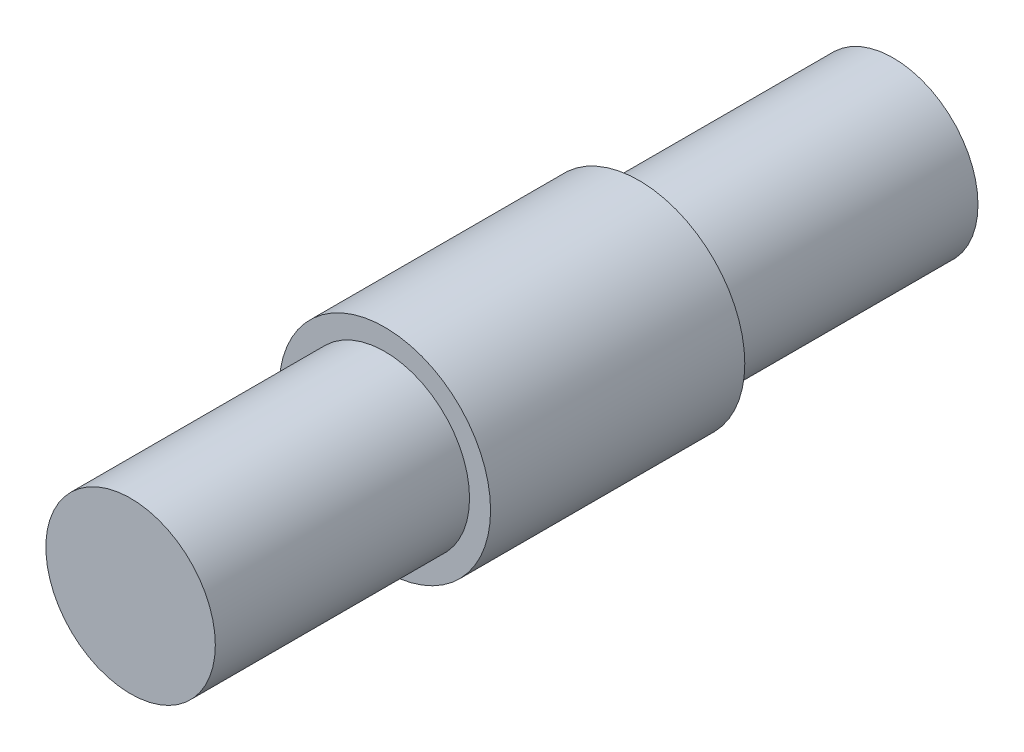
ISO-10303-21;
HEADER;
FILE_DESCRIPTION(('STEP AP214'),'2;1');
FILE_NAME('part.step','',(''),(''),'','','');
FILE_SCHEMA(('AUTOMOTIVE_DESIGN { 1 0 10303 214 1 1 1 1 }'));
ENDSEC;
DATA;
#1=APPLICATION_CONTEXT('core data for automotive mechanical design processes');
#2=APPLICATION_PROTOCOL_DEFINITION('international standard','automotive_design',2000,#1);
#3=PRODUCT_CONTEXT('',#1,'mechanical');
#4=PRODUCT('Part','Part','',(#3));
#5=PRODUCT_RELATED_PRODUCT_CATEGORY('part','',(#4));
#6=PRODUCT_DEFINITION_FORMATION('','',#4);
#7=PRODUCT_DEFINITION_CONTEXT('part definition',#1,'design');
#8=PRODUCT_DEFINITION('design','',#6,#7);
#9=PRODUCT_DEFINITION_SHAPE('','',#8);
#10=(LENGTH_UNIT() NAMED_UNIT(*) SI_UNIT(.MILLI.,.METRE.));
#11=(NAMED_UNIT(*) PLANE_ANGLE_UNIT() SI_UNIT($,.RADIAN.));
#12=(NAMED_UNIT(*) SI_UNIT($,.STERADIAN.) SOLID_ANGLE_UNIT());
#13=UNCERTAINTY_MEASURE_WITH_UNIT(LENGTH_MEASURE(1.E-05),#10,'distance_accuracy_value','');
#14=(GEOMETRIC_REPRESENTATION_CONTEXT(3) GLOBAL_UNCERTAINTY_ASSIGNED_CONTEXT((#13)) GLOBAL_UNIT_ASSIGNED_CONTEXT((#10,
#11,#12)) REPRESENTATION_CONTEXT('',''));
#15=CARTESIAN_POINT('',(0.,0.,0.));
#16=DIRECTION('',(0.,0.,1.));
#17=DIRECTION('',(1.,0.,0.));
#18=AXIS2_PLACEMENT_3D('',#15,#16,#17);
#19=CARTESIAN_POINT('',(0.,0.,4.7625));
#20=DIRECTION('',(0.,0.,-1.));
#21=DIRECTION('',(-1.,0.,0.));
#22=AXIS2_PLACEMENT_3D('',#19,#20,#21);
#23=CYLINDRICAL_SURFACE('',#22,3.9624);
#24=CARTESIAN_POINT('',(0.,0.,4.7625));
#25=DIRECTION('',(0.,0.,1.));
#26=DIRECTION('',(1.,0.,0.));
#27=AXIS2_PLACEMENT_3D('',#24,#25,#26);
#28=CIRCLE('',#27,3.9624);
#29=CARTESIAN_POINT('',(3.9624,0.,4.7625));
#30=VERTEX_POINT('',#29);
#31=EDGE_CURVE('E44',#30,#30,#28,.T.);
#32=ORIENTED_EDGE('',*,*,#31,.F.);
#33=EDGE_LOOP('',(#32));
#34=FACE_BOUND('',#33,.T.);
#35=CARTESIAN_POINT('',(0.,0.,-4.7625));
#36=DIRECTION('',(0.,0.,1.));
#37=DIRECTION('',(1.,0.,0.));
#38=AXIS2_PLACEMENT_3D('',#35,#36,#37);
#39=CIRCLE('',#38,3.9624);
#40=CARTESIAN_POINT('',(3.9624,0.,-4.7625));
#41=VERTEX_POINT('',#40);
#42=EDGE_CURVE('E49',#41,#41,#39,.T.);
#43=ORIENTED_EDGE('',*,*,#42,.T.);
#44=EDGE_LOOP('',(#43));
#45=FACE_BOUND('',#44,.T.);
#46=ADVANCED_FACE('F37',(#34,#45),#23,.T.);
#47=CARTESIAN_POINT('',(0.,0.,4.7625));
#48=DIRECTION('',(0.,0.,1.));
#49=DIRECTION('',(1.,0.,0.));
#50=AXIS2_PLACEMENT_3D('',#47,#48,#49);
#51=PLANE('',#50);
#52=CARTESIAN_POINT('',(0.,0.,4.7625));
#53=DIRECTION('',(0.,0.,1.));
#54=DIRECTION('',(1.,0.,0.));
#55=AXIS2_PLACEMENT_3D('',#52,#53,#54);
#56=CIRCLE('',#55,3.175);
#57=CARTESIAN_POINT('',(3.175,0.,4.7625));
#58=VERTEX_POINT('',#57);
#59=EDGE_CURVE('E55',#58,#58,#56,.F.);
#60=ORIENTED_EDGE('',*,*,#59,.T.);
#61=EDGE_LOOP('',(#60));
#62=FACE_BOUND('',#61,.T.);
#63=ORIENTED_EDGE('',*,*,#31,.T.);
#64=EDGE_LOOP('',(#63));
#65=FACE_BOUND('',#64,.T.);
#66=ADVANCED_FACE('F87',(#62,#65),#51,.T.);
#67=CARTESIAN_POINT('',(0.,0.,-4.7625));
#68=DIRECTION('',(0.,0.,1.));
#69=DIRECTION('',(1.,0.,0.));
#70=AXIS2_PLACEMENT_3D('',#67,#68,#69);
#71=PLANE('',#70);
#72=CARTESIAN_POINT('',(0.,0.,-4.7625));
#73=DIRECTION('',(0.,0.,1.));
#74=DIRECTION('',(1.,0.,0.));
#75=AXIS2_PLACEMENT_3D('',#72,#73,#74);
#76=CIRCLE('',#75,3.175);
#77=CARTESIAN_POINT('',(3.175,0.,-4.7625));
#78=VERTEX_POINT('',#77);
#79=EDGE_CURVE('E10',#78,#78,#76,.F.);
#80=ORIENTED_EDGE('',*,*,#79,.F.);
#81=EDGE_LOOP('',(#80));
#82=FACE_BOUND('',#81,.T.);
#83=ORIENTED_EDGE('',*,*,#42,.F.);
#84=EDGE_LOOP('',(#83));
#85=FACE_BOUND('',#84,.T.);
#86=ADVANCED_FACE('F92',(#82,#85),#71,.F.);
#87=CARTESIAN_POINT('',(0.,0.,-14.2875));
#88=DIRECTION('',(0.,0.,1.));
#89=DIRECTION('',(1.,0.,0.));
#90=AXIS2_PLACEMENT_3D('',#87,#88,#89);
#91=PLANE('',#90);
#92=CARTESIAN_POINT('',(0.,0.,-14.2875));
#93=DIRECTION('',(0.,0.,1.));
#94=DIRECTION('',(1.,0.,0.));
#95=AXIS2_PLACEMENT_3D('',#92,#93,#94);
#96=CIRCLE('',#95,3.175);
#97=CARTESIAN_POINT('',(3.175,0.,-14.2875));
#98=VERTEX_POINT('',#97);
#99=EDGE_CURVE('E61',#98,#98,#96,.T.);
#100=ORIENTED_EDGE('',*,*,#99,.F.);
#101=EDGE_LOOP('',(#100));
#102=FACE_BOUND('',#101,.T.);
#103=ADVANCED_FACE('F81',(#102),#91,.F.);
#104=CARTESIAN_POINT('',(0.,0.,14.2875));
#105=DIRECTION('',(0.,0.,-1.));
#106=DIRECTION('',(-1.,0.,0.));
#107=AXIS2_PLACEMENT_3D('',#104,#105,#106);
#108=CYLINDRICAL_SURFACE('',#107,3.175);
#109=ORIENTED_EDGE('',*,*,#99,.T.);
#110=EDGE_LOOP('',(#109));
#111=FACE_BOUND('',#110,.T.);
#112=ORIENTED_EDGE('',*,*,#79,.T.);
#113=EDGE_LOOP('',(#112));
#114=FACE_BOUND('',#113,.T.);
#115=ADVANCED_FACE('F73',(#111,#114),#108,.T.);
#116=ORIENTED_EDGE('',*,*,#59,.F.);
#117=EDGE_LOOP('',(#116));
#118=FACE_BOUND('',#117,.T.);
#119=CARTESIAN_POINT('',(0.,0.,14.2875));
#120=DIRECTION('',(0.,0.,1.));
#121=DIRECTION('',(1.,0.,0.));
#122=AXIS2_PLACEMENT_3D('',#119,#120,#121);
#123=CIRCLE('',#122,3.175);
#124=CARTESIAN_POINT('',(3.175,0.,14.2875));
#125=VERTEX_POINT('',#124);
#126=EDGE_CURVE('E60',#125,#125,#123,.T.);
#127=ORIENTED_EDGE('',*,*,#126,.F.);
#128=EDGE_LOOP('',(#127));
#129=FACE_BOUND('',#128,.T.);
#130=ADVANCED_FACE('F71',(#118,#129),#108,.T.);
#131=CARTESIAN_POINT('',(0.,0.,14.2875));
#132=DIRECTION('',(0.,0.,1.));
#133=DIRECTION('',(1.,0.,0.));
#134=AXIS2_PLACEMENT_3D('',#131,#132,#133);
#135=PLANE('',#134);
#136=ORIENTED_EDGE('',*,*,#126,.T.);
#137=EDGE_LOOP('',(#136));
#138=FACE_BOUND('',#137,.T.);
#139=ADVANCED_FACE('F69',(#138),#135,.T.);
#140=CLOSED_SHELL('',(#46,#66,#86,#103,#115,#130,#139));
#141=MANIFOLD_SOLID_BREP('B2',#140);
#142=ADVANCED_BREP_SHAPE_REPRESENTATION('',(#18,#141),#14);
#143=SHAPE_DEFINITION_REPRESENTATION(#9,#142);
ENDSEC;
END-ISO-10303-21;
